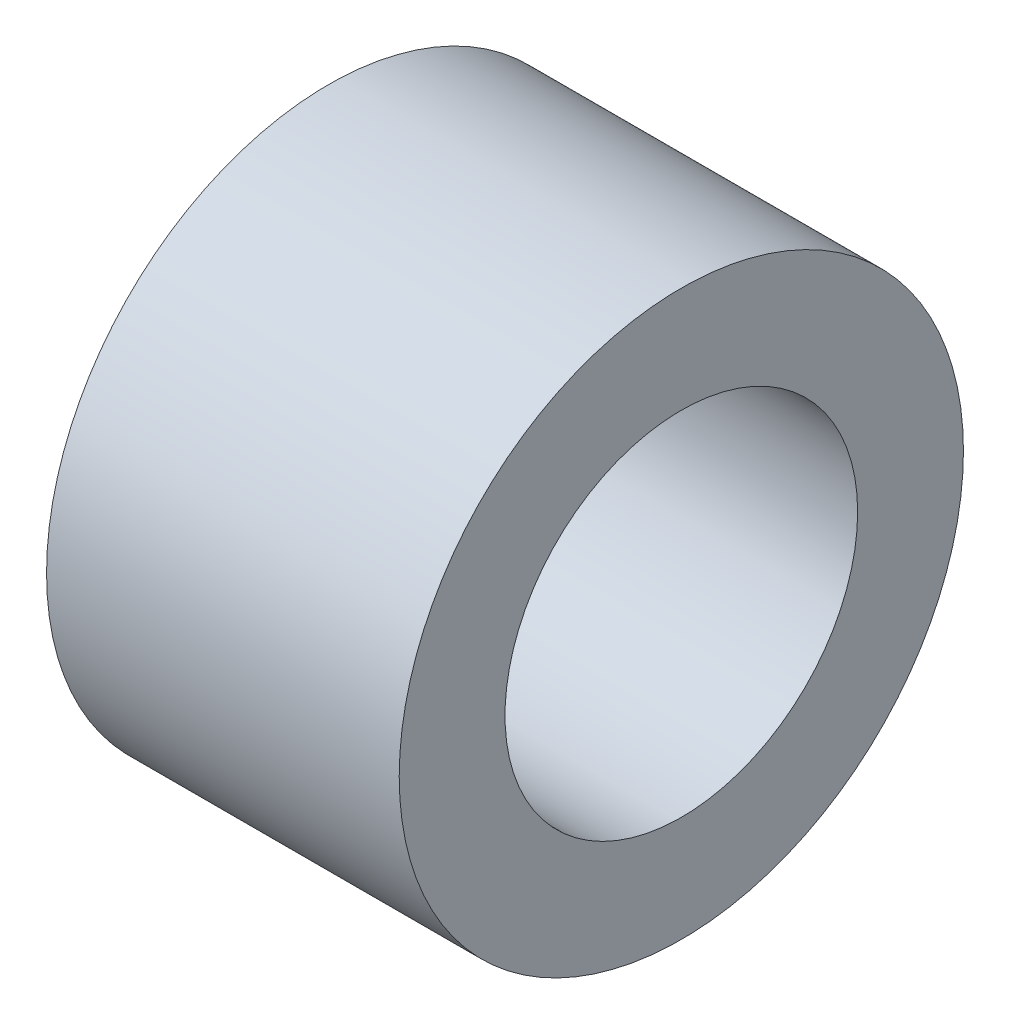
ISO-10303-21;
HEADER;
FILE_DESCRIPTION(('STEP AP214'),'2;1');
FILE_NAME('part.step','',(''),(''),'','','');
FILE_SCHEMA(('AUTOMOTIVE_DESIGN { 1 0 10303 214 1 1 1 1 }'));
ENDSEC;
DATA;
#1=APPLICATION_CONTEXT('core data for automotive mechanical design processes');
#2=APPLICATION_PROTOCOL_DEFINITION('international standard','automotive_design',2000,#1);
#3=PRODUCT_CONTEXT('',#1,'mechanical');
#4=PRODUCT('Part','Part','',(#3));
#5=PRODUCT_RELATED_PRODUCT_CATEGORY('part','',(#4));
#6=PRODUCT_DEFINITION_FORMATION('','',#4);
#7=PRODUCT_DEFINITION_CONTEXT('part definition',#1,'design');
#8=PRODUCT_DEFINITION('design','',#6,#7);
#9=PRODUCT_DEFINITION_SHAPE('','',#8);
#10=(LENGTH_UNIT() NAMED_UNIT(*) SI_UNIT(.MILLI.,.METRE.));
#11=(NAMED_UNIT(*) PLANE_ANGLE_UNIT() SI_UNIT($,.RADIAN.));
#12=(NAMED_UNIT(*) SI_UNIT($,.STERADIAN.) SOLID_ANGLE_UNIT());
#13=UNCERTAINTY_MEASURE_WITH_UNIT(LENGTH_MEASURE(1.E-05),#10,'distance_accuracy_value','');
#14=(GEOMETRIC_REPRESENTATION_CONTEXT(3) GLOBAL_UNCERTAINTY_ASSIGNED_CONTEXT((#13)) GLOBAL_UNIT_ASSIGNED_CONTEXT((#10,
#11,#12)) REPRESENTATION_CONTEXT('',''));
#15=CARTESIAN_POINT('',(0.,0.,0.));
#16=DIRECTION('',(0.,0.,1.));
#17=DIRECTION('',(1.,0.,0.));
#18=AXIS2_PLACEMENT_3D('',#15,#16,#17);
#19=CARTESIAN_POINT('',(4.7625,0.,0.));
#20=DIRECTION('',(-1.,0.,0.));
#21=DIRECTION('',(0.,0.,1.));
#22=AXIS2_PLACEMENT_3D('',#19,#20,#21);
#23=CYLINDRICAL_SURFACE('',#22,3.81);
#24=CARTESIAN_POINT('',(4.7625,0.,0.));
#25=DIRECTION('',(1.,0.,0.));
#26=DIRECTION('',(0.,0.,-1.));
#27=AXIS2_PLACEMENT_3D('',#24,#25,#26);
#28=CIRCLE('',#27,3.81);
#29=CARTESIAN_POINT('',(4.7625,0.,-3.81));
#30=VERTEX_POINT('',#29);
#31=EDGE_CURVE('E10',#30,#30,#28,.T.);
#32=ORIENTED_EDGE('',*,*,#31,.F.);
#33=EDGE_LOOP('',(#32));
#34=FACE_BOUND('',#33,.T.);
#35=CARTESIAN_POINT('',(0.,0.,0.));
#36=DIRECTION('',(1.,0.,0.));
#37=DIRECTION('',(0.,0.,-1.));
#38=AXIS2_PLACEMENT_3D('',#35,#36,#37);
#39=CIRCLE('',#38,3.81);
#40=CARTESIAN_POINT('',(0.,0.,-3.81));
#41=VERTEX_POINT('',#40);
#42=EDGE_CURVE('E43',#41,#41,#39,.T.);
#43=ORIENTED_EDGE('',*,*,#42,.T.);
#44=EDGE_LOOP('',(#43));
#45=FACE_BOUND('',#44,.T.);
#46=ADVANCED_FACE('F40',(#34,#45),#23,.T.);
#47=CARTESIAN_POINT('',(4.7625,0.,0.));
#48=DIRECTION('',(1.,0.,0.));
#49=DIRECTION('',(0.,0.,-1.));
#50=AXIS2_PLACEMENT_3D('',#47,#48,#49);
#51=PLANE('',#50);
#52=CARTESIAN_POINT('',(4.7625,0.,0.));
#53=DIRECTION('',(1.,0.,0.));
#54=DIRECTION('',(0.,0.,-1.));
#55=AXIS2_PLACEMENT_3D('',#52,#53,#54);
#56=CIRCLE('',#55,2.38125);
#57=CARTESIAN_POINT('',(4.7625,0.,-2.38125));
#58=VERTEX_POINT('',#57);
#59=EDGE_CURVE('E54',#58,#58,#56,.T.);
#60=ORIENTED_EDGE('',*,*,#59,.F.);
#61=EDGE_LOOP('',(#60));
#62=FACE_BOUND('',#61,.T.);
#63=ORIENTED_EDGE('',*,*,#31,.T.);
#64=EDGE_LOOP('',(#63));
#65=FACE_BOUND('',#64,.T.);
#66=ADVANCED_FACE('F71',(#62,#65),#51,.T.);
#67=CARTESIAN_POINT('',(0.,0.,0.));
#68=DIRECTION('',(1.,0.,0.));
#69=DIRECTION('',(0.,0.,-1.));
#70=AXIS2_PLACEMENT_3D('',#67,#68,#69);
#71=PLANE('',#70);
#72=CARTESIAN_POINT('',(0.,0.,0.));
#73=DIRECTION('',(1.,0.,0.));
#74=DIRECTION('',(0.,0.,-1.));
#75=AXIS2_PLACEMENT_3D('',#72,#73,#74);
#76=CIRCLE('',#75,2.38125);
#77=CARTESIAN_POINT('',(0.,0.,-2.38125));
#78=VERTEX_POINT('',#77);
#79=EDGE_CURVE('E52',#78,#78,#76,.T.);
#80=ORIENTED_EDGE('',*,*,#79,.T.);
#81=EDGE_LOOP('',(#80));
#82=FACE_BOUND('',#81,.T.);
#83=ORIENTED_EDGE('',*,*,#42,.F.);
#84=EDGE_LOOP('',(#83));
#85=FACE_BOUND('',#84,.T.);
#86=ADVANCED_FACE('F62',(#82,#85),#71,.F.);
#87=CARTESIAN_POINT('',(0.,0.,0.));
#88=DIRECTION('',(1.,0.,0.));
#89=DIRECTION('',(0.,0.,-1.));
#90=AXIS2_PLACEMENT_3D('',#87,#88,#89);
#91=CYLINDRICAL_SURFACE('',#90,2.38125);
#92=ORIENTED_EDGE('',*,*,#79,.F.);
#93=EDGE_LOOP('',(#92));
#94=FACE_BOUND('',#93,.T.);
#95=ORIENTED_EDGE('',*,*,#59,.T.);
#96=EDGE_LOOP('',(#95));
#97=FACE_BOUND('',#96,.T.);
#98=ADVANCED_FACE('F65',(#94,#97),#91,.F.);
#99=CLOSED_SHELL('',(#46,#66,#86,#98));
#100=MANIFOLD_SOLID_BREP('B2',#99);
#101=ADVANCED_BREP_SHAPE_REPRESENTATION('',(#18,#100),#14);
#102=SHAPE_DEFINITION_REPRESENTATION(#9,#101);
ENDSEC;
END-ISO-10303-21;
